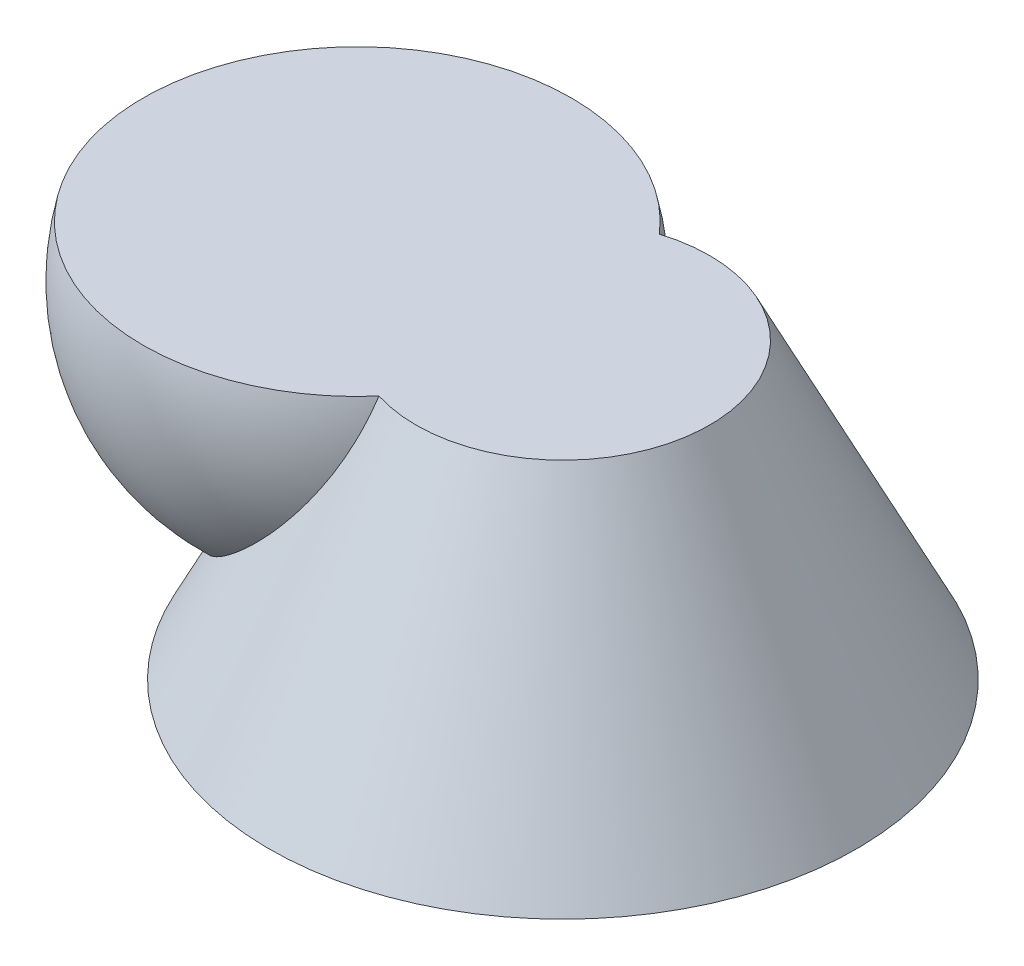
ISO-10303-21;
HEADER;
FILE_DESCRIPTION(('STEP AP214'),'2;1');
FILE_NAME('part.step','',(''),(''),'','','');
FILE_SCHEMA(('AUTOMOTIVE_DESIGN { 1 0 10303 214 1 1 1 1 }'));
ENDSEC;
DATA;
#1=APPLICATION_CONTEXT('core data for automotive mechanical design processes');
#2=APPLICATION_PROTOCOL_DEFINITION('international standard','automotive_design',2000,#1);
#3=PRODUCT_CONTEXT('',#1,'mechanical');
#4=PRODUCT('Part','Part','',(#3));
#5=PRODUCT_RELATED_PRODUCT_CATEGORY('part','',(#4));
#6=PRODUCT_DEFINITION_FORMATION('','',#4);
#7=PRODUCT_DEFINITION_CONTEXT('part definition',#1,'design');
#8=PRODUCT_DEFINITION('design','',#6,#7);
#9=PRODUCT_DEFINITION_SHAPE('','',#8);
#10=(LENGTH_UNIT() NAMED_UNIT(*) SI_UNIT(.MILLI.,.METRE.));
#11=(NAMED_UNIT(*) PLANE_ANGLE_UNIT() SI_UNIT($,.RADIAN.));
#12=(NAMED_UNIT(*) SI_UNIT($,.STERADIAN.) SOLID_ANGLE_UNIT());
#13=UNCERTAINTY_MEASURE_WITH_UNIT(LENGTH_MEASURE(1.E-05),#10,'distance_accuracy_value','');
#14=(GEOMETRIC_REPRESENTATION_CONTEXT(3) GLOBAL_UNCERTAINTY_ASSIGNED_CONTEXT((#13)) GLOBAL_UNIT_ASSIGNED_CONTEXT((#10,
#11,#12)) REPRESENTATION_CONTEXT('',''));
#15=CARTESIAN_POINT('',(0.,0.,0.));
#16=DIRECTION('',(0.,0.,1.));
#17=DIRECTION('',(1.,0.,0.));
#18=AXIS2_PLACEMENT_3D('',#15,#16,#17);
#19=CARTESIAN_POINT('',(28.,80.,0.));
#20=DIRECTION('',(0.,-1.,0.));
#21=DIRECTION('',(1.,0.,0.));
#22=AXIS2_PLACEMENT_3D('',#19,#20,#21);
#23=CONICAL_SURFACE('',#22,0.,0.463647609000806);
#24=CARTESIAN_POINT('',(28.,0.,0.));
#25=DIRECTION('',(0.,1.,0.));
#26=DIRECTION('',(-1.,0.,0.));
#27=AXIS2_PLACEMENT_3D('',#24,#25,#26);
#28=CIRCLE('',#27,40.);
#29=CARTESIAN_POINT('',(-12.,0.,0.));
#30=VERTEX_POINT('',#29);
#31=EDGE_CURVE('E54',#30,#30,#28,.T.);
#32=ORIENTED_EDGE('',*,*,#31,.T.);
#33=EDGE_LOOP('',(#32));
#34=FACE_BOUND('',#33,.T.);
#35=CARTESIAN_POINT('',(16.8951118836962,57.7902237673924,0.));
#36=CARTESIAN_POINT('',(16.8951154748471,57.790220268942,-0.326142741314132));
#37=CARTESIAN_POINT('',(16.9034548508866,57.7780956368421,-0.652341435703653));
#38=CARTESIAN_POINT('',(16.9365345978576,57.7298340468546,-1.30214383067422));
#39=CARTESIAN_POINT('',(16.9612784182379,57.6936920387034,-1.62574697098687));
#40=CARTESIAN_POINT('',(17.0263655061556,57.5980626560614,-2.26822011395797));
#41=CARTESIAN_POINT('',(17.0667246603557,57.5385515054475,-2.58708495180286));
#42=CARTESIAN_POINT('',(17.1617433645192,57.3972953380106,-3.21764332707041));
#43=CARTESIAN_POINT('',(17.2164037122734,57.3155490807943,-3.52933646336471));
#44=CARTESIAN_POINT('',(17.3515898523317,57.1112660758875,-4.2103245112025));
#45=CARTESIAN_POINT('',(17.435152299625,56.9837326519518,-4.57752068721901));
#46=CARTESIAN_POINT('',(17.6177232900767,56.7005597434724,-5.29689938311784));
#47=CARTESIAN_POINT('',(17.7167354634696,56.5449136519152,-5.64907834956761));
#48=CARTESIAN_POINT('',(17.9268266956944,56.2082047883551,-6.33768071528792));
#49=CARTESIAN_POINT('',(18.0379174430087,56.0271173462643,-6.67408839400487));
#50=CARTESIAN_POINT('',(18.2687292129334,55.6422789927895,-7.33068388774432));
#51=CARTESIAN_POINT('',(18.3884534048826,55.4385197435236,-7.65086567203709));
#52=CARTESIAN_POINT('',(18.6065575435431,55.0575732517489,-8.2070786863919));
#53=CARTESIAN_POINT('',(18.7038916675084,54.8842951183735,-8.44622206366024));
#54=CARTESIAN_POINT('',(18.9004204452421,54.5265487250863,-8.9150666938789));
#55=CARTESIAN_POINT('',(18.9996146780934,54.3420829761651,-9.14477004630985));
#56=CARTESIAN_POINT('',(19.2981457633956,53.773071371134,-9.82077537482202));
#57=CARTESIAN_POINT('',(19.4983453141492,53.3730584368417,-10.2537608605528));
#58=CARTESIAN_POINT('',(19.8920836369923,52.5375447802016,-11.0895721104273));
#59=CARTESIAN_POINT('',(20.0856022829045,52.1019482280917,-11.4923104245894));
#60=CARTESIAN_POINT('',(20.4574662789182,51.2015935114846,-12.2712197284819));
#61=CARTESIAN_POINT('',(20.6358126100444,50.7368372358037,-12.6473924356468));
#62=CARTESIAN_POINT('',(20.9144639798327,49.9427283256952,-13.2552296885722));
#63=CARTESIAN_POINT('',(21.0208923778414,49.6201963303836,-13.4930740734484));
#64=CARTESIAN_POINT('',(21.2223599422234,48.9654698530644,-13.9601951819163));
#65=CARTESIAN_POINT('',(21.3173985491721,48.6332748974426,-14.1894714842949));
#66=CARTESIAN_POINT('',(21.4945493620388,47.9603448677531,-14.6405050283897));
#67=CARTESIAN_POINT('',(21.5766590044466,47.6196081155336,-14.8622607721336));
#68=CARTESIAN_POINT('',(21.7265789566974,46.9307702711809,-15.2990634040321));
#69=CARTESIAN_POINT('',(21.7943894998104,46.5826692992866,-15.5141104015819));
#70=CARTESIAN_POINT('',(21.9144457201874,45.8807740937715,-15.9378193958889));
#71=CARTESIAN_POINT('',(21.966717556704,45.5269904976159,-16.1464915869213));
#72=CARTESIAN_POINT('',(22.0548799845888,44.8142061513661,-16.558326033918));
#73=CARTESIAN_POINT('',(22.0907705415253,44.4552053903075,-16.7614882783));
#74=CARTESIAN_POINT('',(22.1453870439653,43.7330508487145,-17.1625982553865));
#75=CARTESIAN_POINT('',(22.1641146977327,43.3698974851421,-17.3605465051469));
#76=CARTESIAN_POINT('',(22.1838225110827,42.6404025157922,-17.7513939026326));
#77=CARTESIAN_POINT('',(22.1848027213273,42.274060919119,-17.9442930647695));
#78=CARTESIAN_POINT('',(22.1686617567302,41.5412628805865,-18.3239359021007));
#79=CARTESIAN_POINT('',(22.151644549589,41.174819191442,-18.5107085755795));
#80=CARTESIAN_POINT('',(22.0994566887828,40.440635465298,-18.8790977231623));
#81=CARTESIAN_POINT('',(22.0642860450609,40.0728954290087,-19.0607142000903));
#82=CARTESIAN_POINT('',(21.975740341379,39.3369621076234,-19.4185243153647));
#83=CARTESIAN_POINT('',(21.9223654067244,38.9687688256646,-19.5947179910286));
#84=CARTESIAN_POINT('',(21.7975280817134,38.232708721641,-19.9413138551252));
#85=CARTESIAN_POINT('',(21.7260637097134,37.8648419397767,-20.1117154067267));
#86=CARTESIAN_POINT('',(21.4847576467081,36.7624051064366,-20.6137658045697));
#87=CARTESIAN_POINT('',(21.2880376582424,36.0292854426137,-20.9361208166036));
#88=CARTESIAN_POINT('',(20.8263682517197,34.5725023291639,-21.5515287335692));
#89=CARTESIAN_POINT('',(20.5614211439326,33.8488385602183,-21.8445826302131));
#90=CARTESIAN_POINT('',(19.9914157252442,32.4711997597897,-22.3749741031917));
#91=CARTESIAN_POINT('',(19.6911544759996,31.8162220006998,-22.6148813880129));
#92=CARTESIAN_POINT('',(19.0411542806304,30.5199151213868,-23.0620752443718));
#93=CARTESIAN_POINT('',(18.6914188206579,29.8785850431531,-23.2693641121624));
#94=CARTESIAN_POINT('',(17.9472685112907,28.6114621812919,-23.6476605154337));
#95=CARTESIAN_POINT('',(17.5528584109373,27.9856677547869,-23.8186719017718));
#96=CARTESIAN_POINT('',(16.7243240622667,26.7509916057311,-24.1209976772457));
#97=CARTESIAN_POINT('',(16.290197390219,26.1421109183125,-24.2523096415896));
#98=CARTESIAN_POINT('',(15.3550677564255,24.899540728896,-24.4798968219092));
#99=CARTESIAN_POINT('',(14.8515021844452,24.2671943238773,-24.5729920023049));
#100=CARTESIAN_POINT('',(13.81117162555,23.0246142158338,-24.7063617105112));
#101=CARTESIAN_POINT('',(13.2744053811498,22.4143813517559,-24.7466342363638));
#102=CARTESIAN_POINT('',(12.1740953186022,21.2170100084515,-24.7712328390896));
#103=CARTESIAN_POINT('',(11.6105431129527,20.6298788696814,-24.7555412764992));
#104=CARTESIAN_POINT('',(10.4635323263204,19.480045714839,-24.6654986608107));
#105=CARTESIAN_POINT('',(9.88007350128505,18.9173439984607,-24.5911468882984));
#106=CARTESIAN_POINT('',(8.67837202262942,17.7972768392109,-24.3777366710865));
#107=CARTESIAN_POINT('',(8.05963923335557,17.2408684609813,-24.236399413748));
#108=CARTESIAN_POINT('',(6.81589260830496,16.1568714040118,-23.8864765032641));
#109=CARTESIAN_POINT('',(6.1908785324549,15.6292838318125,-23.6778882702162));
#110=CARTESIAN_POINT('',(4.94258277495465,14.6044091018631,-23.1923295461962));
#111=CARTESIAN_POINT('',(4.31930099121623,14.107120120787,-22.9153631752002));
#112=CARTESIAN_POINT('',(3.0825768839033,13.1443634570405,-22.2926524749782));
#113=CARTESIAN_POINT('',(2.46913397931807,12.6788938900182,-21.9469122233037));
#114=CARTESIAN_POINT('',(1.28755023065293,11.8016109099782,-21.2042207646707));
#115=CARTESIAN_POINT('',(0.718613226599276,11.3883252960724,-20.8102759247364));
#116=CARTESIAN_POINT('',(-0.395551166018257,10.5937342778412,-19.9612404998298));
#117=CARTESIAN_POINT('',(-0.940778841412007,10.2124284865796,-19.5061506548479));
#118=CARTESIAN_POINT('',(-2.00007865390367,9.48349459357753,-18.5370329379495));
#119=CARTESIAN_POINT('',(-2.51416283485252,9.13585344147381,-18.0230280750083));
#120=CARTESIAN_POINT('',(-3.5042643871424,8.47567225590282,-16.9388667321157));
#121=CARTESIAN_POINT('',(-3.9802851911897,8.16312905613264,-16.3687153260547));
#122=CARTESIAN_POINT('',(-4.84865307015223,7.59982655166231,-15.2270742448682));
#123=CARTESIAN_POINT('',(-5.24467408274356,7.34607069222293,-14.6598528136571));
#124=CARTESIAN_POINT('',(-5.99415098261614,6.87037084080739,-13.4853400914388));
#125=CARTESIAN_POINT('',(-6.34760910658166,6.64842517708541,-12.8780509085944));
#126=CARTESIAN_POINT('',(-7.00720536971335,6.23751933254655,-11.6279899739246));
#127=CARTESIAN_POINT('',(-7.31336288853123,6.04854563857347,-10.9852329010141));
#128=CARTESIAN_POINT('',(-7.87438175547782,5.70447002848219,-9.66899435323091));
#129=CARTESIAN_POINT('',(-8.12924635744652,5.54936596374224,-8.99551483060785));
#130=CARTESIAN_POINT('',(-8.56626396049433,5.28471049871762,-7.67734156548405));
#131=CARTESIAN_POINT('',(-8.75255592251104,5.17253794111252,-7.03454215038319));
#132=CARTESIAN_POINT('',(-9.07633677483175,4.97822371255889,-5.73233535892405));
#133=CARTESIAN_POINT('',(-9.2138284808499,4.89608030895728,-5.07292894312102));
#134=CARTESIAN_POINT('',(-9.43828921893903,4.76225517727081,-3.742701785866));
#135=CARTESIAN_POINT('',(-9.52527133081506,4.71056556291817,-3.07188404580981));
#136=CARTESIAN_POINT('',(-9.64768139996645,4.63788332842282,-1.72391000720981));
#137=CARTESIAN_POINT('',(-9.68311046360003,4.61689004951894,-1.0467538450061));
#138=CARTESIAN_POINT('',(-9.70154848782038,4.60596099858382,0.277798124489342));
#139=CARTESIAN_POINT('',(-9.68685989240555,4.61466109530784,0.925152158536939));
#140=CARTESIAN_POINT('',(-9.61027027762788,4.66009237584836,2.21605357409119));
#141=CARTESIAN_POINT('',(-9.54837103740936,4.69682250334656,2.85960109812608));
#142=CARTESIAN_POINT('',(-9.37807545507972,4.7981338028355,4.13823144686786));
#143=CARTESIAN_POINT('',(-9.26968306448141,4.86271260793372,4.77331498621111));
#144=CARTESIAN_POINT('',(-9.00762724773459,5.01941900283435,6.03060907936579));
#145=CARTESIAN_POINT('',(-8.8539634167206,5.11154683900967,6.65281951799897));
#146=CARTESIAN_POINT('',(-8.50378173523431,5.32250688278374,7.87764173023554));
#147=CARTESIAN_POINT('',(-8.30743787380137,5.4412307276759,8.48032198105037));
#148=CARTESIAN_POINT('',(-7.87367386548139,5.70506867386297,9.66473667262726));
#149=CARTESIAN_POINT('',(-7.63625410712927,5.85018252553675,10.24647131145));
#150=CARTESIAN_POINT('',(-7.1228375970167,6.16620244545621,11.3854153485256));
#151=CARTESIAN_POINT('',(-6.84683869273346,6.33710995290093,11.9426233760341));
#152=CARTESIAN_POINT('',(-6.25911678855931,6.70403267654132,13.0292279156656));
#153=CARTESIAN_POINT('',(-5.94739287698262,6.90004853350559,13.5586237175302));
#154=CARTESIAN_POINT('',(-5.27992361611884,7.32369759939091,14.6046040871203));
#155=CARTESIAN_POINT('',(-4.92302439071744,7.55219325845186,15.12010294875));
#156=CARTESIAN_POINT('',(-4.17801084625716,8.03442106190574,16.1154809571341));
#157=CARTESIAN_POINT('',(-3.78989600001054,8.28815363253159,16.5953595020485));
#158=CARTESIAN_POINT('',(-2.98626448559743,8.82001540162816,17.5172849847574));
#159=CARTESIAN_POINT('',(-2.57074348827786,9.0981484567701,17.9593259201537));
#160=CARTESIAN_POINT('',(-1.71637694689398,9.6778711194956,18.803648270221));
#161=CARTESIAN_POINT('',(-1.27753063366977,9.97946150074428,19.2059283725132));
#162=CARTESIAN_POINT('',(-0.351315449681278,10.6256397967556,19.9942233319361));
#163=CARTESIAN_POINT('',(0.137352466793587,10.9717486809056,20.3774749508794));
#164=CARTESIAN_POINT('',(0.882867258096564,11.5092302366954,20.9163479377518));
#165=CARTESIAN_POINT('',(1.13347496146427,11.6914566737903,21.0899820000056));
#166=CARTESIAN_POINT('',(1.63833619179418,12.0619568477749,21.4252269710309));
#167=CARTESIAN_POINT('',(1.89259040387389,12.2502317295281,21.5868355841707));
#168=CARTESIAN_POINT('',(2.65985252775759,12.8239140412287,22.0534637879839));
#169=CARTESIAN_POINT('',(3.1773978465533,13.218206377748,22.3403130428709));
#170=CARTESIAN_POINT('',(4.21949479789438,14.0293964605865,22.8651920804913));
#171=CARTESIAN_POINT('',(4.74404693071944,14.4462958275982,23.103218357252));
#172=CARTESIAN_POINT('',(5.55377009723485,15.1052277221595,23.432465376076));
#173=CARTESIAN_POINT('',(5.83825057832501,15.339645599191,23.540906455762));
#174=CARTESIAN_POINT('',(6.40700652770609,15.8146186588207,23.7436404809269));
#175=CARTESIAN_POINT('',(6.69128202763245,16.0551724559737,23.8379365877225));
#176=CARTESIAN_POINT('',(7.54284019290128,16.7859791267718,24.0998129045835));
#177=CARTESIAN_POINT('',(8.1088778187262,17.2853961582604,24.2463905182274));
#178=CARTESIAN_POINT('',(9.23154681736266,18.3075113381437,24.4846919555496));
#179=CARTESIAN_POINT('',(9.7881755030506,18.8302159873749,24.576400357854));
#180=CARTESIAN_POINT('',(10.886141080833,19.8978702897994,24.7066124932632));
#181=CARTESIAN_POINT('',(11.4274774971947,20.4428206337553,24.7451145729348));
#182=CARTESIAN_POINT('',(12.5276755343442,21.5943460795281,24.7719165254841));
#183=CARTESIAN_POINT('',(13.0849577061429,22.2025232588786,24.7563701310383));
#184=CARTESIAN_POINT('',(14.1684255441128,23.4421851348694,24.6694855018897));
#185=CARTESIAN_POINT('',(14.69460961758,24.0736710225903,24.5981444122938));
#186=CARTESIAN_POINT('',(15.7092665212694,25.3589330032058,24.403138289913));
#187=CARTESIAN_POINT('',(16.1977237532965,26.0127181564057,24.2794517503494));
#188=CARTESIAN_POINT('',(17.1299942049777,27.3408755157826,23.9836979881997));
#189=CARTESIAN_POINT('',(17.5738074302686,28.0152477193601,23.8116307717223));
#190=CARTESIAN_POINT('',(18.4188784194958,29.3968801265325,23.4194532941368));
#191=CARTESIAN_POINT('',(18.8190750049553,30.1045313247303,23.1984289249116));
#192=CARTESIAN_POINT('',(19.559585704202,31.5370576666354,22.71543233353));
#193=CARTESIAN_POINT('',(19.8998984774085,32.2619331955205,22.4534591949275));
#194=CARTESIAN_POINT('',(20.5142801489757,33.7250501438704,21.8939646002423));
#195=CARTESIAN_POINT('',(20.7884120408286,34.4632781285928,21.5964773542425));
#196=CARTESIAN_POINT('',(21.2657157799016,35.9495697110667,20.970847052857));
#197=CARTESIAN_POINT('',(21.4688940428465,36.6976324131993,20.6427067725635));
#198=CARTESIAN_POINT('',(21.7899379666169,38.14992819939,19.982372986629));
#199=CARTESIAN_POINT('',(21.9124713408646,38.8538669380716,19.6518141759004));
#200=CARTESIAN_POINT('',(22.0463677144708,39.9086729448976,19.1411261801482));
#201=CARTESIAN_POINT('',(22.0826839180365,40.2601333120599,18.96840029758));
#202=CARTESIAN_POINT('',(22.1387321115851,40.9620008760419,18.6182062945518));
#203=CARTESIAN_POINT('',(22.1584656451014,41.312408167857,18.4407386170503));
#204=CARTESIAN_POINT('',(22.1815061959947,42.0116097458043,18.081108276873));
#205=CARTESIAN_POINT('',(22.1848031263947,42.3604029102369,17.8989428001073));
#206=CARTESIAN_POINT('',(22.1752509921724,43.0553494569485,17.5300588597804));
#207=CARTESIAN_POINT('',(22.1624019140376,43.4015028370182,17.3433403924091));
#208=CARTESIAN_POINT('',(22.1210150555394,44.0903068750222,16.9652750969977));
#209=CARTESIAN_POINT('',(22.0924777763708,44.4329576444991,16.7739284170028));
#210=CARTESIAN_POINT('',(22.0203280477538,45.1138937498662,16.3863814690308));
#211=CARTESIAN_POINT('',(21.9767156512883,45.4521791010946,16.1901812181142));
#212=CARTESIAN_POINT('',(21.8765234328335,46.114641130123,15.79780453385));
#213=CARTESIAN_POINT('',(21.8203157163064,46.4389546599771,15.6017637888648));
#214=CARTESIAN_POINT('',(21.6951886292583,47.0817569303039,15.204263464291));
#215=CARTESIAN_POINT('',(21.6262691542479,47.4002456228734,15.0028038401715));
#216=CARTESIAN_POINT('',(21.4766922977211,48.0305894293308,14.5938287758045));
#217=CARTESIAN_POINT('',(21.3960328076832,48.3424433400474,14.3863122530942));
#218=CARTESIAN_POINT('',(21.2241091124811,48.9585679772298,13.9645288847441));
#219=CARTESIAN_POINT('',(21.1328449626011,49.262838743218,13.7502620742991));
#220=CARTESIAN_POINT('',(20.9410480190752,49.8626346834461,13.3143003592243));
#221=CARTESIAN_POINT('',(20.840522585928,50.158166560398,13.0926114410938));
#222=CARTESIAN_POINT('',(20.6315385751692,50.7397624979387,12.6406878128217));
#223=CARTESIAN_POINT('',(20.5230797386346,51.025826249073,12.4104528238826));
#224=CARTESIAN_POINT('',(20.2998324522738,51.5872887989859,11.9405152629745));
#225=CARTESIAN_POINT('',(20.1850469362664,51.8626924418932,11.7008170936776));
#226=CARTESIAN_POINT('',(19.9508298499955,52.4017736425364,11.2107963343453));
#227=CARTESIAN_POINT('',(19.8313988116179,52.665452535324,10.9604749603094));
#228=CARTESIAN_POINT('',(19.5681405028566,53.2258580677422,10.4022102258028));
#229=CARTESIAN_POINT('',(19.4237715380516,53.5200565939934,10.0919705351764));
#230=CARTESIAN_POINT('',(19.134645882856,54.0879639050562,9.45338891782067));
#231=CARTESIAN_POINT('',(18.9898892075406,54.3616734748917,9.12504768548068));
#232=CARTESIAN_POINT('',(18.7040434918295,54.8854864872719,8.44909790191834));
#233=CARTESIAN_POINT('',(18.5629505044106,55.1356161687896,8.10151146678247));
#234=CARTESIAN_POINT('',(18.2886257991821,55.609301699584,7.38569773747603));
#235=CARTESIAN_POINT('',(18.1553922667901,55.8328636949684,7.01747524632301));
#236=CARTESIAN_POINT('',(17.9272200502254,56.2075419282428,6.3367158756134));
#237=CARTESIAN_POINT('',(17.8299865498537,56.3641650524482,6.02798108193243));
#238=CARTESIAN_POINT('',(17.6461019037337,56.6560843187576,5.39757348468794));
#239=CARTESIAN_POINT('',(17.5594479329845,56.7913861569999,5.07590416560071));
#240=CARTESIAN_POINT('',(17.3993801667286,57.0384089207055,4.42099222082451));
#241=CARTESIAN_POINT('',(17.3259461345521,57.1501659332913,4.08776823156367));
#242=CARTESIAN_POINT('',(17.1945960715583,57.3483090843144,3.41090411118737));
#243=CARTESIAN_POINT('',(17.1366745500923,57.434704200631,3.06726771360665));
#244=CARTESIAN_POINT('',(17.0561813050762,57.554049352895,2.49756570838417));
#245=CARTESIAN_POINT('',(17.02839878361,57.5950310806965,2.27388213898095));
#246=CARTESIAN_POINT('',(16.9804357159,57.6655734577309,1.82392416506921));
#247=CARTESIAN_POINT('',(16.960254140538,57.6951356531073,1.59765011557229));
#248=CARTESIAN_POINT('',(16.9278217329318,57.7425601110673,1.14325322568487));
#249=CARTESIAN_POINT('',(16.9155728543359,57.7604194915182,0.915129943864602));
#250=CARTESIAN_POINT('',(16.899217202155,57.7842517694396,0.458013559562845));
#251=CARTESIAN_POINT('',(16.8951093619554,57.790226224038,0.229020574966555));
#252=CARTESIAN_POINT('',(16.8951118836962,57.7902237673924,0.));
#253=B_SPLINE_CURVE_WITH_KNOTS('',3,(#35,#36,#37,#38,#39,#40,#41,#42,#43,#44,#45,#46,#47,#48,
#49,#50,#51,#52,#53,#54,#55,#56,#57,#58,#59,#60,#61,#62,#63,#64,#65,#66,#67,#68,#69,#70,#71,#72,
#73,#74,#75,#76,#77,#78,#79,#80,#81,#82,#83,#84,#85,#86,#87,#88,#89,#90,#91,#92,#93,#94,#95,#96,
#97,#98,#99,#100,#101,#102,#103,#104,#105,#106,#107,#108,#109,#110,#111,#112,#113,#114,#115,
#116,#117,#118,#119,#120,#121,#122,#123,#124,#125,#126,#127,#128,#129,#130,#131,#132,#133,#134,
#135,#136,#137,#138,#139,#140,#141,#142,#143,#144,#145,#146,#147,#148,#149,#150,#151,#152,#153,
#154,#155,#156,#157,#158,#159,#160,#161,#162,#163,#164,#165,#166,#167,#168,#169,#170,#171,#172,
#173,#174,#175,#176,#177,#178,#179,#180,#181,#182,#183,#184,#185,#186,#187,#188,#189,#190,#191,
#192,#193,#194,#195,#196,#197,#198,#199,#200,#201,#202,#203,#204,#205,#206,#207,#208,#209,#210,
#211,#212,#213,#214,#215,#216,#217,#218,#219,#220,#221,#222,#223,#224,#225,#226,#227,#228,#229,
#230,#231,#232,#233,#234,#235,#236,#237,#238,#239,#240,#241,#242,#243,#244,#245,#246,#247,#248,
#249,#250,#251,#252),.UNSPECIFIED.,.T.,.F.,(4,2,2,2,2,2,2,2,2,2,2,2,2,2,2,2,2,2,2,2,2,2,2,2,2,2,
2,2,2,2,2,2,2,2,2,2,2,2,2,2,2,2,2,2,2,2,2,2,2,2,2,2,2,2,2,2,2,2,2,2,2,2,2,2,2,2,2,2,2,2,2,2,2,2,
2,2,2,2,2,2,2,2,2,2,2,2,2,2,2,2,2,2,2,2,2,2,2,2,2,2,2,2,2,2,2,2,2,2,4),(0.,0.978197312442458,
1.95660038084359,2.93600148140882,3.91545722942614,5.10645462056262,6.29773228389714,
7.49017318793597,8.68305408778257,9.61553571050218,10.547808812543,12.4131674154491,
14.2837265869402,16.1541647181194,17.3977554810187,18.6414072995247,19.8853053953446,
21.1291831971241,22.3709549275102,23.6127292679562,24.8543799982606,26.0960271841259,
27.3305405856051,28.5650533109064,29.7995575388675,31.0341970616433,33.5044351440764,
35.9745895916346,38.2503637259422,40.5259775798467,42.8013497561559,45.076860881334,
47.515223609714,49.9536787484236,52.3929025379316,54.8321562427665,57.3611043676102,
59.8901495202783,62.419042327996,64.9477852442287,67.3626809808605,69.7775474945204,
72.1914740867587,74.6051827354188,76.8128645963729,79.0204303927385,81.2270893093227,
83.43360819917,85.4668046651618,87.4998837991646,89.53243621836,91.5649450171616,
93.5053598155418,95.4457014925447,97.3858782900732,99.3260724392586,101.258500779555,
103.190910842105,105.123428766511,107.055996018874,109.05576817106,111.055574103667,
113.055696691355,115.055885274707,117.186271670344,118.251608270161,119.317147721398,
121.448064821899,123.579134889797,124.731574881003,125.883756923796,128.188027005418,
130.492944414331,132.797933448964,135.270208991465,137.742611043206,140.216029899757,
142.689448444009,145.213664829519,147.737937715853,150.259798345082,152.781430885121,
155.139977429256,156.319533420803,157.498979605807,158.679149515967,159.859320413789,
161.039453610599,162.219582659774,163.368605047888,164.517636881264,165.666875337439,
166.816107802689,167.964434655989,169.112799004026,170.260635238969,171.408340437823,
172.761393629631,174.114394953335,175.465872473654,176.817036735116,177.894894172198,
178.972463161762,180.048368350192,181.123892217488,181.810805759913,182.497626265302,
183.184615855194,183.871515431814),.UNSPECIFIED.);
#254=CARTESIAN_POINT('',(22.0535714285714,40.,-19.095548885667));
#255=VERTEX_POINT('',#254);
#256=CARTESIAN_POINT('',(22.0535714285714,40.,19.095548885667));
#257=VERTEX_POINT('',#256);
#258=EDGE_CURVE('E45',#255,#257,#253,.T.);
#259=ORIENTED_EDGE('',*,*,#258,.F.);
#260=CARTESIAN_POINT('',(28.,40.,0.));
#261=DIRECTION('',(0.,1.,0.));
#262=DIRECTION('',(0.,0.,1.));
#263=AXIS2_PLACEMENT_3D('',#260,#261,#262);
#264=CIRCLE('',#263,20.);
#265=EDGE_CURVE('E55',#255,#257,#264,.F.);
#266=ORIENTED_EDGE('',*,*,#265,.T.);
#267=EDGE_LOOP('',(#259,#266));
#268=FACE_BOUND('',#267,.T.);
#269=ADVANCED_FACE('F36',(#34,#268),#23,.T.);
#270=CARTESIAN_POINT('',(0.,33.,0.));
#271=DIRECTION('',(0.,-1.,0.));
#272=DIRECTION('',(-1.,0.,0.));
#273=AXIS2_PLACEMENT_3D('',#270,#271,#272);
#274=SPHERICAL_SURFACE('',#273,30.);
#275=CARTESIAN_POINT('',(0.,40.,0.));
#276=DIRECTION('',(0.,1.,0.));
#277=DIRECTION('',(0.,0.,1.));
#278=AXIS2_PLACEMENT_3D('',#275,#276,#277);
#279=CIRCLE('',#278,29.1719042916296);
#280=EDGE_CURVE('E12',#255,#257,#279,.T.);
#281=ORIENTED_EDGE('',*,*,#280,.F.);
#282=ORIENTED_EDGE('',*,*,#258,.T.);
#283=EDGE_LOOP('',(#281,#282));
#284=FACE_BOUND('',#283,.T.);
#285=ADVANCED_FACE('F38',(#284),#274,.T.);
#286=CARTESIAN_POINT('',(28.,0.,0.));
#287=DIRECTION('',(0.,-1.,0.));
#288=DIRECTION('',(1.,0.,0.));
#289=AXIS2_PLACEMENT_3D('',#286,#287,#288);
#290=PLANE('',#289);
#291=ORIENTED_EDGE('',*,*,#31,.F.);
#292=EDGE_LOOP('',(#291));
#293=FACE_BOUND('',#292,.T.);
#294=ADVANCED_FACE('F60',(#293),#290,.T.);
#295=CARTESIAN_POINT('',(0.,40.,0.));
#296=DIRECTION('',(0.,1.,0.));
#297=DIRECTION('',(0.,0.,1.));
#298=AXIS2_PLACEMENT_3D('',#295,#296,#297);
#299=PLANE('',#298);
#300=ORIENTED_EDGE('',*,*,#265,.F.);
#301=ORIENTED_EDGE('',*,*,#280,.T.);
#302=EDGE_LOOP('',(#300,#301));
#303=FACE_BOUND('',#302,.T.);
#304=ADVANCED_FACE('F58',(#303),#299,.T.);
#305=CLOSED_SHELL('',(#269,#285,#294,#304));
#306=MANIFOLD_SOLID_BREP('B2',#305);
#307=ADVANCED_BREP_SHAPE_REPRESENTATION('',(#18,#306),#14);
#308=SHAPE_DEFINITION_REPRESENTATION(#9,#307);
ENDSEC;
END-ISO-10303-21;
